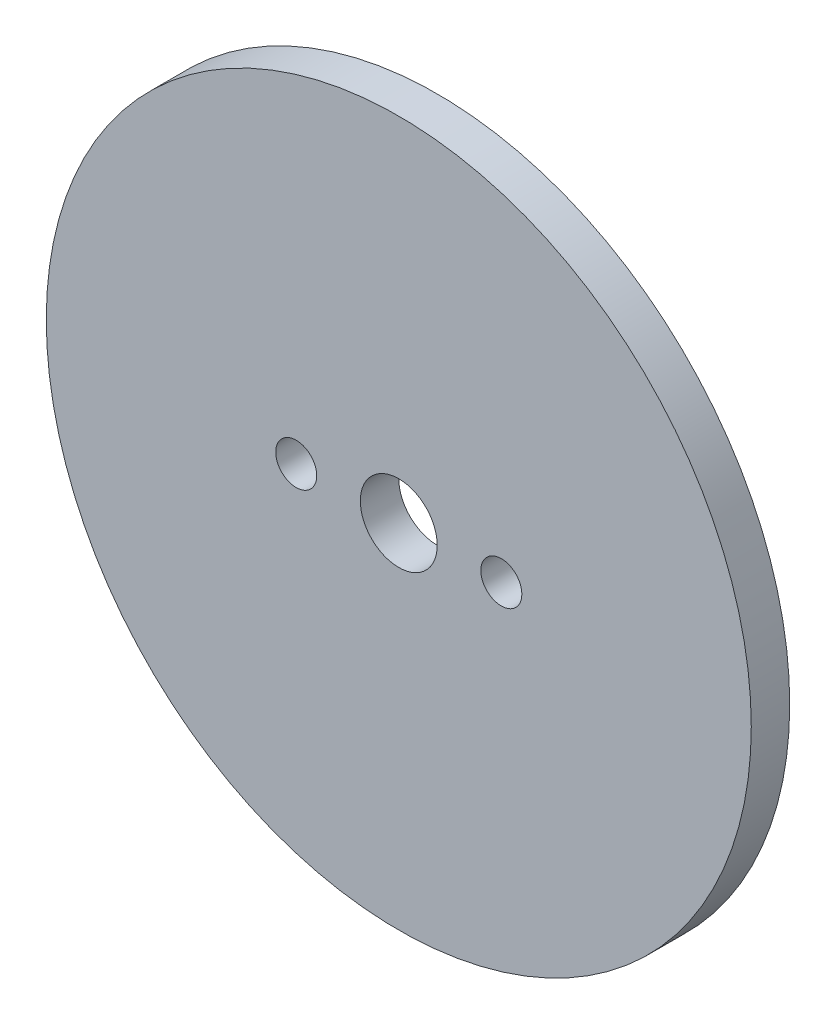
ISO-10303-21;
HEADER;
FILE_DESCRIPTION(('STEP AP214'),'2;1');
FILE_NAME('part.step','',(''),(''),'','','');
FILE_SCHEMA(('AUTOMOTIVE_DESIGN { 1 0 10303 214 1 1 1 1 }'));
ENDSEC;
DATA;
#1=APPLICATION_CONTEXT('core data for automotive mechanical design processes');
#2=APPLICATION_PROTOCOL_DEFINITION('international standard','automotive_design',2000,#1);
#3=PRODUCT_CONTEXT('',#1,'mechanical');
#4=PRODUCT('Part','Part','',(#3));
#5=PRODUCT_RELATED_PRODUCT_CATEGORY('part','',(#4));
#6=PRODUCT_DEFINITION_FORMATION('','',#4);
#7=PRODUCT_DEFINITION_CONTEXT('part definition',#1,'design');
#8=PRODUCT_DEFINITION('design','',#6,#7);
#9=PRODUCT_DEFINITION_SHAPE('','',#8);
#10=(LENGTH_UNIT() NAMED_UNIT(*) SI_UNIT(.MILLI.,.METRE.));
#11=(NAMED_UNIT(*) PLANE_ANGLE_UNIT() SI_UNIT($,.RADIAN.));
#12=(NAMED_UNIT(*) SI_UNIT($,.STERADIAN.) SOLID_ANGLE_UNIT());
#13=UNCERTAINTY_MEASURE_WITH_UNIT(LENGTH_MEASURE(1.E-05),#10,'distance_accuracy_value','');
#14=(GEOMETRIC_REPRESENTATION_CONTEXT(3) GLOBAL_UNCERTAINTY_ASSIGNED_CONTEXT((#13)) GLOBAL_UNIT_ASSIGNED_CONTEXT((#10,
#11,#12)) REPRESENTATION_CONTEXT('',''));
#15=CARTESIAN_POINT('',(0.,0.,0.));
#16=DIRECTION('',(0.,0.,1.));
#17=DIRECTION('',(1.,0.,0.));
#18=AXIS2_PLACEMENT_3D('',#15,#16,#17);
#19=CARTESIAN_POINT('',(0.,0.,1.5));
#20=DIRECTION('',(0.,0.,1.));
#21=DIRECTION('',(1.,0.,0.));
#22=AXIS2_PLACEMENT_3D('',#19,#20,#21);
#23=PLANE('',#22);
#24=CARTESIAN_POINT('',(-8.,0.,1.5));
#25=DIRECTION('',(0.,0.,1.));
#26=DIRECTION('',(1.,0.,0.));
#27=AXIS2_PLACEMENT_3D('',#24,#25,#26);
#28=CIRCLE('',#27,1.6);
#29=CARTESIAN_POINT('',(-6.4,0.,1.5));
#30=VERTEX_POINT('',#29);
#31=EDGE_CURVE('E48',#30,#30,#28,.T.);
#32=ORIENTED_EDGE('',*,*,#31,.F.);
#33=EDGE_LOOP('',(#32));
#34=FACE_BOUND('',#33,.T.);
#35=CARTESIAN_POINT('',(0.,0.,1.5));
#36=DIRECTION('',(0.,0.,1.));
#37=DIRECTION('',(1.,0.,0.));
#38=AXIS2_PLACEMENT_3D('',#35,#36,#37);
#39=CIRCLE('',#38,27.5);
#40=CARTESIAN_POINT('',(27.5,0.,1.5));
#41=VERTEX_POINT('',#40);
#42=EDGE_CURVE('E10',#41,#41,#39,.T.);
#43=ORIENTED_EDGE('',*,*,#42,.T.);
#44=EDGE_LOOP('',(#43));
#45=FACE_BOUND('',#44,.T.);
#46=CARTESIAN_POINT('',(0.,0.,1.5));
#47=DIRECTION('',(0.,0.,1.));
#48=DIRECTION('',(1.,0.,0.));
#49=AXIS2_PLACEMENT_3D('',#46,#47,#48);
#50=CIRCLE('',#49,3.);
#51=CARTESIAN_POINT('',(3.,0.,1.5));
#52=VERTEX_POINT('',#51);
#53=EDGE_CURVE('E43',#52,#52,#50,.T.);
#54=ORIENTED_EDGE('',*,*,#53,.F.);
#55=EDGE_LOOP('',(#54));
#56=FACE_BOUND('',#55,.T.);
#57=CARTESIAN_POINT('',(8.,0.,1.5));
#58=DIRECTION('',(0.,0.,1.));
#59=DIRECTION('',(1.,0.,0.));
#60=AXIS2_PLACEMENT_3D('',#57,#58,#59);
#61=CIRCLE('',#60,1.6);
#62=CARTESIAN_POINT('',(9.6,0.,1.5));
#63=VERTEX_POINT('',#62);
#64=EDGE_CURVE('E54',#63,#63,#61,.T.);
#65=ORIENTED_EDGE('',*,*,#64,.F.);
#66=EDGE_LOOP('',(#65));
#67=FACE_BOUND('',#66,.T.);
#68=ADVANCED_FACE('F32',(#34,#45,#56,#67),#23,.T.);
#69=CARTESIAN_POINT('',(0.,0.,-1.5));
#70=DIRECTION('',(0.,0.,1.));
#71=DIRECTION('',(1.,0.,0.));
#72=AXIS2_PLACEMENT_3D('',#69,#70,#71);
#73=PLANE('',#72);
#74=CARTESIAN_POINT('',(0.,0.,-1.5));
#75=DIRECTION('',(0.,0.,1.));
#76=DIRECTION('',(1.,0.,0.));
#77=AXIS2_PLACEMENT_3D('',#74,#75,#76);
#78=CIRCLE('',#77,27.5);
#79=CARTESIAN_POINT('',(27.5,0.,-1.5));
#80=VERTEX_POINT('',#79);
#81=EDGE_CURVE('E36',#80,#80,#78,.T.);
#82=ORIENTED_EDGE('',*,*,#81,.F.);
#83=EDGE_LOOP('',(#82));
#84=FACE_BOUND('',#83,.T.);
#85=CARTESIAN_POINT('',(0.,0.,-1.5));
#86=DIRECTION('',(0.,0.,1.));
#87=DIRECTION('',(1.,0.,0.));
#88=AXIS2_PLACEMENT_3D('',#85,#86,#87);
#89=CIRCLE('',#88,3.);
#90=CARTESIAN_POINT('',(3.,0.,-1.5));
#91=VERTEX_POINT('',#90);
#92=EDGE_CURVE('E45',#91,#91,#89,.T.);
#93=ORIENTED_EDGE('',*,*,#92,.T.);
#94=EDGE_LOOP('',(#93));
#95=FACE_BOUND('',#94,.T.);
#96=CARTESIAN_POINT('',(-8.,0.,-1.5));
#97=DIRECTION('',(0.,0.,1.));
#98=DIRECTION('',(1.,0.,0.));
#99=AXIS2_PLACEMENT_3D('',#96,#97,#98);
#100=CIRCLE('',#99,1.6);
#101=CARTESIAN_POINT('',(-6.4,0.,-1.5));
#102=VERTEX_POINT('',#101);
#103=EDGE_CURVE('E51',#102,#102,#100,.T.);
#104=ORIENTED_EDGE('',*,*,#103,.T.);
#105=EDGE_LOOP('',(#104));
#106=FACE_BOUND('',#105,.T.);
#107=CARTESIAN_POINT('',(8.,0.,-1.5));
#108=DIRECTION('',(0.,0.,1.));
#109=DIRECTION('',(1.,0.,0.));
#110=AXIS2_PLACEMENT_3D('',#107,#108,#109);
#111=CIRCLE('',#110,1.6);
#112=CARTESIAN_POINT('',(9.6,0.,-1.5));
#113=VERTEX_POINT('',#112);
#114=EDGE_CURVE('E57',#113,#113,#111,.T.);
#115=ORIENTED_EDGE('',*,*,#114,.T.);
#116=EDGE_LOOP('',(#115));
#117=FACE_BOUND('',#116,.T.);
#118=ADVANCED_FACE('F67',(#84,#95,#106,#117),#73,.F.);
#119=CARTESIAN_POINT('',(0.,0.,1.5));
#120=DIRECTION('',(0.,0.,-1.));
#121=DIRECTION('',(-1.,0.,0.));
#122=AXIS2_PLACEMENT_3D('',#119,#120,#121);
#123=CYLINDRICAL_SURFACE('',#122,27.5);
#124=ORIENTED_EDGE('',*,*,#42,.F.);
#125=EDGE_LOOP('',(#124));
#126=FACE_BOUND('',#125,.T.);
#127=ORIENTED_EDGE('',*,*,#81,.T.);
#128=EDGE_LOOP('',(#127));
#129=FACE_BOUND('',#128,.T.);
#130=ADVANCED_FACE('F34',(#126,#129),#123,.T.);
#131=CARTESIAN_POINT('',(0.,0.,1.5));
#132=DIRECTION('',(0.,0.,-1.));
#133=DIRECTION('',(-1.,0.,0.));
#134=AXIS2_PLACEMENT_3D('',#131,#132,#133);
#135=CYLINDRICAL_SURFACE('',#134,3.);
#136=ORIENTED_EDGE('',*,*,#53,.T.);
#137=EDGE_LOOP('',(#136));
#138=FACE_BOUND('',#137,.T.);
#139=ORIENTED_EDGE('',*,*,#92,.F.);
#140=EDGE_LOOP('',(#139));
#141=FACE_BOUND('',#140,.T.);
#142=ADVANCED_FACE('F76',(#138,#141),#135,.F.);
#143=CARTESIAN_POINT('',(-8.,0.,1.5));
#144=DIRECTION('',(0.,0.,-1.));
#145=DIRECTION('',(-1.,0.,0.));
#146=AXIS2_PLACEMENT_3D('',#143,#144,#145);
#147=CYLINDRICAL_SURFACE('',#146,1.6);
#148=ORIENTED_EDGE('',*,*,#31,.T.);
#149=EDGE_LOOP('',(#148));
#150=FACE_BOUND('',#149,.T.);
#151=ORIENTED_EDGE('',*,*,#103,.F.);
#152=EDGE_LOOP('',(#151));
#153=FACE_BOUND('',#152,.T.);
#154=ADVANCED_FACE('F79',(#150,#153),#147,.F.);
#155=CARTESIAN_POINT('',(8.,0.,1.5));
#156=DIRECTION('',(0.,0.,-1.));
#157=DIRECTION('',(-1.,0.,0.));
#158=AXIS2_PLACEMENT_3D('',#155,#156,#157);
#159=CYLINDRICAL_SURFACE('',#158,1.6);
#160=ORIENTED_EDGE('',*,*,#64,.T.);
#161=EDGE_LOOP('',(#160));
#162=FACE_BOUND('',#161,.T.);
#163=ORIENTED_EDGE('',*,*,#114,.F.);
#164=EDGE_LOOP('',(#163));
#165=FACE_BOUND('',#164,.T.);
#166=ADVANCED_FACE('F63',(#162,#165),#159,.F.);
#167=CLOSED_SHELL('',(#68,#118,#130,#142,#154,#166));
#168=MANIFOLD_SOLID_BREP('B2',#167);
#169=ADVANCED_BREP_SHAPE_REPRESENTATION('',(#18,#168),#14);
#170=SHAPE_DEFINITION_REPRESENTATION(#9,#169);
ENDSEC;
END-ISO-10303-21;
